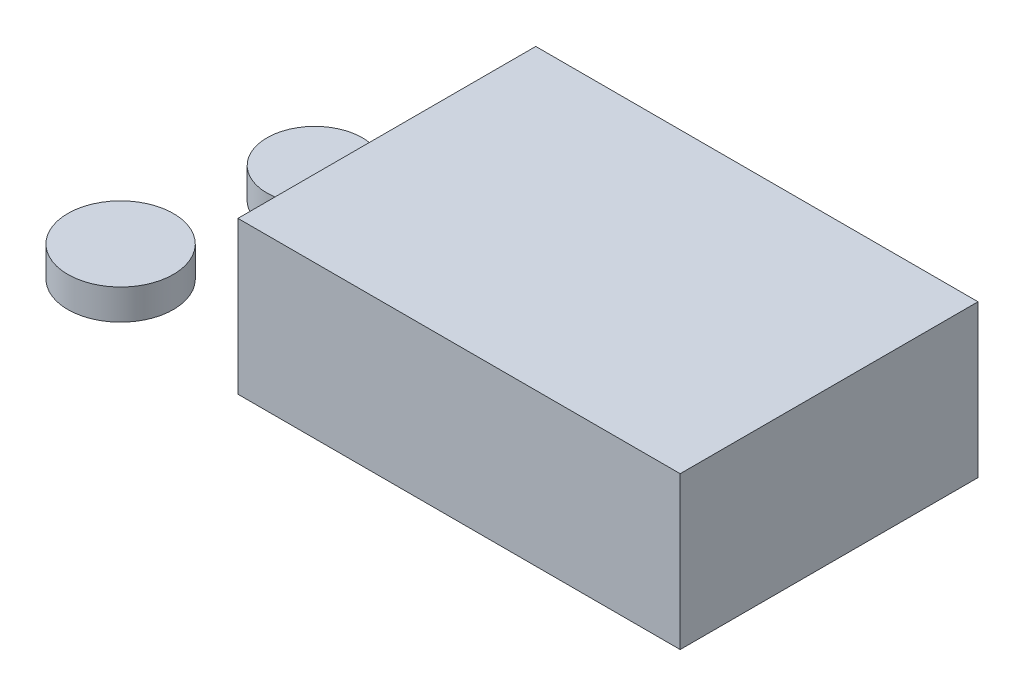
ISO-10303-21;
HEADER;
FILE_DESCRIPTION(('STEP AP214'),'2;1');
FILE_NAME('part.step','',(''),(''),'','','');
FILE_SCHEMA(('AUTOMOTIVE_DESIGN { 1 0 10303 214 1 1 1 1 }'));
ENDSEC;
DATA;
#1=APPLICATION_CONTEXT('core data for automotive mechanical design processes');
#2=APPLICATION_PROTOCOL_DEFINITION('international standard','automotive_design',2000,#1);
#3=PRODUCT_CONTEXT('',#1,'mechanical');
#4=PRODUCT('Part','Part','',(#3));
#5=PRODUCT_RELATED_PRODUCT_CATEGORY('part','',(#4));
#6=PRODUCT_DEFINITION_FORMATION('','',#4);
#7=PRODUCT_DEFINITION_CONTEXT('part definition',#1,'design');
#8=PRODUCT_DEFINITION('design','',#6,#7);
#9=PRODUCT_DEFINITION_SHAPE('','',#8);
#10=(LENGTH_UNIT() NAMED_UNIT(*) SI_UNIT(.MILLI.,.METRE.));
#11=(NAMED_UNIT(*) PLANE_ANGLE_UNIT() SI_UNIT($,.RADIAN.));
#12=(NAMED_UNIT(*) SI_UNIT($,.STERADIAN.) SOLID_ANGLE_UNIT());
#13=UNCERTAINTY_MEASURE_WITH_UNIT(LENGTH_MEASURE(1.E-05),#10,'distance_accuracy_value','');
#14=(GEOMETRIC_REPRESENTATION_CONTEXT(3) GLOBAL_UNCERTAINTY_ASSIGNED_CONTEXT((#13)) GLOBAL_UNIT_ASSIGNED_CONTEXT((#10,
#11,#12)) REPRESENTATION_CONTEXT('',''));
#15=CARTESIAN_POINT('',(0.,0.,0.));
#16=DIRECTION('',(0.,0.,1.));
#17=DIRECTION('',(1.,0.,0.));
#18=AXIS2_PLACEMENT_3D('',#15,#16,#17);
#19=CARTESIAN_POINT('',(-124.56959228351,10.,35.4048944559061));
#20=DIRECTION('',(0.,-1.,0.));
#21=DIRECTION('',(0.,0.,-1.));
#22=AXIS2_PLACEMENT_3D('',#19,#20,#21);
#23=CYLINDRICAL_SURFACE('',#22,17.3343195617082);
#24=CARTESIAN_POINT('',(-124.56959228351,10.,35.4048944559061));
#25=DIRECTION('',(0.,1.,0.));
#26=DIRECTION('',(0.,0.,1.));
#27=AXIS2_PLACEMENT_3D('',#24,#25,#26);
#28=CIRCLE('',#27,17.3343195617082);
#29=CARTESIAN_POINT('',(-124.56959228351,10.,52.7392140176143));
#30=VERTEX_POINT('',#29);
#31=EDGE_CURVE('E11',#30,#30,#28,.T.);
#32=ORIENTED_EDGE('',*,*,#31,.F.);
#33=EDGE_LOOP('',(#32));
#34=FACE_BOUND('',#33,.T.);
#35=CARTESIAN_POINT('',(-124.56959228351,0.,35.4048944559061));
#36=DIRECTION('',(0.,1.,0.));
#37=DIRECTION('',(0.,0.,1.));
#38=AXIS2_PLACEMENT_3D('',#35,#36,#37);
#39=CIRCLE('',#38,17.3343195617082);
#40=CARTESIAN_POINT('',(-124.56959228351,0.,52.7392140176143));
#41=VERTEX_POINT('',#40);
#42=EDGE_CURVE('E47',#41,#41,#39,.T.);
#43=ORIENTED_EDGE('',*,*,#42,.T.);
#44=EDGE_LOOP('',(#43));
#45=FACE_BOUND('',#44,.T.);
#46=ADVANCED_FACE('F44',(#34,#45),#23,.T.);
#47=CARTESIAN_POINT('',(-124.56959228351,10.,35.4048944559061));
#48=DIRECTION('',(0.,1.,0.));
#49=DIRECTION('',(0.,0.,1.));
#50=AXIS2_PLACEMENT_3D('',#47,#48,#49);
#51=PLANE('',#50);
#52=ORIENTED_EDGE('',*,*,#31,.T.);
#53=EDGE_LOOP('',(#52));
#54=FACE_BOUND('',#53,.T.);
#55=ADVANCED_FACE('F59',(#54),#51,.T.);
#56=CARTESIAN_POINT('',(-124.56959228351,0.,35.4048944559061));
#57=DIRECTION('',(0.,1.,0.));
#58=DIRECTION('',(0.,0.,1.));
#59=AXIS2_PLACEMENT_3D('',#56,#57,#58);
#60=PLANE('',#59);
#61=ORIENTED_EDGE('',*,*,#42,.F.);
#62=EDGE_LOOP('',(#61));
#63=FACE_BOUND('',#62,.T.);
#64=ADVANCED_FACE('F57',(#63),#60,.F.);
#65=CLOSED_SHELL('',(#46,#55,#64));
#66=MANIFOLD_SOLID_BREP('B2',#65);
#67=CARTESIAN_POINT('',(-115.030740926207,10.,-18.7852621270622));
#68=DIRECTION('',(0.,-1.,0.));
#69=DIRECTION('',(0.,0.,-1.));
#70=AXIS2_PLACEMENT_3D('',#67,#68,#69);
#71=CYLINDRICAL_SURFACE('',#70,15.6981780799688);
#72=CARTESIAN_POINT('',(-115.030740926207,10.,-18.7852621270622));
#73=DIRECTION('',(0.,1.,0.));
#74=DIRECTION('',(0.,0.,1.));
#75=AXIS2_PLACEMENT_3D('',#72,#73,#74);
#76=CIRCLE('',#75,15.6981780799688);
#77=CARTESIAN_POINT('',(-115.030740926207,10.,-3.08708404709336));
#78=VERTEX_POINT('',#77);
#79=EDGE_CURVE('E43',#78,#78,#76,.T.);
#80=ORIENTED_EDGE('',*,*,#79,.F.);
#81=EDGE_LOOP('',(#80));
#82=FACE_BOUND('',#81,.T.);
#83=CARTESIAN_POINT('',(-115.030740926207,0.,-18.7852621270622));
#84=DIRECTION('',(0.,1.,0.));
#85=DIRECTION('',(0.,0.,1.));
#86=AXIS2_PLACEMENT_3D('',#83,#84,#85);
#87=CIRCLE('',#86,15.6981780799688);
#88=CARTESIAN_POINT('',(-115.030740926207,0.,-3.08708404709336));
#89=VERTEX_POINT('',#88);
#90=EDGE_CURVE('E97',#89,#89,#87,.T.);
#91=ORIENTED_EDGE('',*,*,#90,.T.);
#92=EDGE_LOOP('',(#91));
#93=FACE_BOUND('',#92,.T.);
#94=ADVANCED_FACE('F94',(#82,#93),#71,.T.);
#95=CARTESIAN_POINT('',(-115.030740926207,10.,-18.7852621270622));
#96=DIRECTION('',(0.,1.,0.));
#97=DIRECTION('',(0.,0.,1.));
#98=AXIS2_PLACEMENT_3D('',#95,#96,#97);
#99=PLANE('',#98);
#100=ORIENTED_EDGE('',*,*,#79,.T.);
#101=EDGE_LOOP('',(#100));
#102=FACE_BOUND('',#101,.T.);
#103=ADVANCED_FACE('F109',(#102),#99,.T.);
#104=CARTESIAN_POINT('',(-115.030740926207,0.,-18.7852621270622));
#105=DIRECTION('',(0.,1.,0.));
#106=DIRECTION('',(0.,0.,1.));
#107=AXIS2_PLACEMENT_3D('',#104,#105,#106);
#108=PLANE('',#107);
#109=ORIENTED_EDGE('',*,*,#90,.F.);
#110=EDGE_LOOP('',(#109));
#111=FACE_BOUND('',#110,.T.);
#112=ADVANCED_FACE('F107',(#111),#108,.F.);
#113=CLOSED_SHELL('',(#94,#103,#112));
#114=MANIFOLD_SOLID_BREP('B6',#113);
#115=CARTESIAN_POINT('',(72.5812751737693,50.,48.8785340192358));
#116=DIRECTION('',(-1.,0.,0.));
#117=DIRECTION('',(0.,0.,1.));
#118=AXIS2_PLACEMENT_3D('',#115,#116,#117);
#119=PLANE('',#118);
#120=DIRECTION('',(0.,0.,-1.));
#121=VECTOR('',#120,1.);
#122=CARTESIAN_POINT('',(72.5812751737693,0.,48.8785340192358));
#123=LINE('',#122,#121);
#124=CARTESIAN_POINT('',(72.5812751737693,0.,48.8785340192358));
#125=VERTEX_POINT('',#124);
#126=CARTESIAN_POINT('',(72.5812751737693,0.,-48.8785340192358));
#127=VERTEX_POINT('',#126);
#128=EDGE_CURVE('E198',#125,#127,#123,.T.);
#129=ORIENTED_EDGE('',*,*,#128,.T.);
#130=DIRECTION('',(0.,-1.,0.));
#131=VECTOR('',#130,1.);
#132=CARTESIAN_POINT('',(72.5812751737693,50.,-48.8785340192358));
#133=LINE('',#132,#131);
#134=CARTESIAN_POINT('',(72.5812751737693,50.,-48.8785340192358));
#135=VERTEX_POINT('',#134);
#136=EDGE_CURVE('E92',#135,#127,#133,.T.);
#137=ORIENTED_EDGE('',*,*,#136,.F.);
#138=DIRECTION('',(0.,0.,-1.));
#139=VECTOR('',#138,1.);
#140=CARTESIAN_POINT('',(72.5812751737693,50.,48.8785340192358));
#141=LINE('',#140,#139);
#142=CARTESIAN_POINT('',(72.5812751737693,50.,48.8785340192358));
#143=VERTEX_POINT('',#142);
#144=EDGE_CURVE('E186',#143,#135,#141,.T.);
#145=ORIENTED_EDGE('',*,*,#144,.F.);
#146=DIRECTION('',(0.,-1.,0.));
#147=VECTOR('',#146,1.);
#148=CARTESIAN_POINT('',(72.5812751737693,50.,48.8785340192358));
#149=LINE('',#148,#147);
#150=EDGE_CURVE('E194',#143,#125,#149,.T.);
#151=ORIENTED_EDGE('',*,*,#150,.T.);
#152=EDGE_LOOP('',(#129,#137,#145,#151));
#153=FACE_BOUND('',#152,.T.);
#154=ADVANCED_FACE('F135',(#153),#119,.F.);
#155=CARTESIAN_POINT('',(-72.5812751737693,50.,-48.8785340192358));
#156=DIRECTION('',(0.,0.,1.));
#157=DIRECTION('',(1.,0.,0.));
#158=AXIS2_PLACEMENT_3D('',#155,#156,#157);
#159=PLANE('',#158);
#160=DIRECTION('',(-1.,0.,0.));
#161=VECTOR('',#160,1.);
#162=CARTESIAN_POINT('',(-72.5812751737693,0.,-48.8785340192358));
#163=LINE('',#162,#161);
#164=CARTESIAN_POINT('',(-72.5812751737693,0.,-48.8785340192358));
#165=VERTEX_POINT('',#164);
#166=EDGE_CURVE('E190',#127,#165,#163,.T.);
#167=ORIENTED_EDGE('',*,*,#166,.T.);
#168=DIRECTION('',(0.,-1.,0.));
#169=VECTOR('',#168,1.);
#170=CARTESIAN_POINT('',(-72.5812751737693,50.,-48.8785340192358));
#171=LINE('',#170,#169);
#172=CARTESIAN_POINT('',(-72.5812751737693,50.,-48.8785340192358));
#173=VERTEX_POINT('',#172);
#174=EDGE_CURVE('E143',#173,#165,#171,.T.);
#175=ORIENTED_EDGE('',*,*,#174,.F.);
#176=DIRECTION('',(-1.,0.,0.));
#177=VECTOR('',#176,1.);
#178=CARTESIAN_POINT('',(-72.5812751737693,50.,-48.8785340192358));
#179=LINE('',#178,#177);
#180=EDGE_CURVE('E181',#135,#173,#179,.T.);
#181=ORIENTED_EDGE('',*,*,#180,.F.);
#182=ORIENTED_EDGE('',*,*,#136,.T.);
#183=EDGE_LOOP('',(#167,#175,#181,#182));
#184=FACE_BOUND('',#183,.T.);
#185=ADVANCED_FACE('F189',(#184),#159,.F.);
#186=CARTESIAN_POINT('',(-72.5812751737693,50.,48.8785340192358));
#187=DIRECTION('',(1.,0.,0.));
#188=DIRECTION('',(0.,0.,-1.));
#189=AXIS2_PLACEMENT_3D('',#186,#187,#188);
#190=PLANE('',#189);
#191=DIRECTION('',(0.,0.,1.));
#192=VECTOR('',#191,1.);
#193=CARTESIAN_POINT('',(-72.5812751737693,0.,48.8785340192358));
#194=LINE('',#193,#192);
#195=CARTESIAN_POINT('',(-72.5812751737693,0.,48.8785340192358));
#196=VERTEX_POINT('',#195);
#197=EDGE_CURVE('E168',#165,#196,#194,.T.);
#198=ORIENTED_EDGE('',*,*,#197,.T.);
#199=DIRECTION('',(0.,-1.,0.));
#200=VECTOR('',#199,1.);
#201=CARTESIAN_POINT('',(-72.5812751737693,50.,48.8785340192358));
#202=LINE('',#201,#200);
#203=CARTESIAN_POINT('',(-72.5812751737693,50.,48.8785340192358));
#204=VERTEX_POINT('',#203);
#205=EDGE_CURVE('E191',#204,#196,#202,.T.);
#206=ORIENTED_EDGE('',*,*,#205,.F.);
#207=DIRECTION('',(0.,0.,1.));
#208=VECTOR('',#207,1.);
#209=CARTESIAN_POINT('',(-72.5812751737693,50.,48.8785340192358));
#210=LINE('',#209,#208);
#211=EDGE_CURVE('E184',#173,#204,#210,.T.);
#212=ORIENTED_EDGE('',*,*,#211,.F.);
#213=ORIENTED_EDGE('',*,*,#174,.T.);
#214=EDGE_LOOP('',(#198,#206,#212,#213));
#215=FACE_BOUND('',#214,.T.);
#216=ADVANCED_FACE('F192',(#215),#190,.F.);
#217=CARTESIAN_POINT('',(-72.5812751737693,50.,48.8785340192358));
#218=DIRECTION('',(0.,0.,-1.));
#219=DIRECTION('',(-1.,0.,0.));
#220=AXIS2_PLACEMENT_3D('',#217,#218,#219);
#221=PLANE('',#220);
#222=DIRECTION('',(1.,0.,0.));
#223=VECTOR('',#222,1.);
#224=CARTESIAN_POINT('',(-72.5812751737693,0.,48.8785340192358));
#225=LINE('',#224,#223);
#226=EDGE_CURVE('E174',#196,#125,#225,.T.);
#227=ORIENTED_EDGE('',*,*,#226,.T.);
#228=ORIENTED_EDGE('',*,*,#150,.F.);
#229=DIRECTION('',(1.,0.,0.));
#230=VECTOR('',#229,1.);
#231=CARTESIAN_POINT('',(-72.5812751737693,50.,48.8785340192358));
#232=LINE('',#231,#230);
#233=EDGE_CURVE('E151',#204,#143,#232,.T.);
#234=ORIENTED_EDGE('',*,*,#233,.F.);
#235=ORIENTED_EDGE('',*,*,#205,.T.);
#236=EDGE_LOOP('',(#227,#228,#234,#235));
#237=FACE_BOUND('',#236,.T.);
#238=ADVANCED_FACE('F205',(#237),#221,.F.);
#239=CARTESIAN_POINT('',(0.,50.,0.));
#240=DIRECTION('',(0.,-1.,0.));
#241=DIRECTION('',(0.,0.,-1.));
#242=AXIS2_PLACEMENT_3D('',#239,#240,#241);
#243=PLANE('',#242);
#244=ORIENTED_EDGE('',*,*,#144,.T.);
#245=ORIENTED_EDGE('',*,*,#180,.T.);
#246=ORIENTED_EDGE('',*,*,#211,.T.);
#247=ORIENTED_EDGE('',*,*,#233,.T.);
#248=EDGE_LOOP('',(#244,#245,#246,#247));
#249=FACE_BOUND('',#248,.T.);
#250=ADVANCED_FACE('F182',(#249),#243,.F.);
#251=CARTESIAN_POINT('',(0.,0.,0.));
#252=DIRECTION('',(0.,-1.,0.));
#253=DIRECTION('',(0.,0.,-1.));
#254=AXIS2_PLACEMENT_3D('',#251,#252,#253);
#255=PLANE('',#254);
#256=ORIENTED_EDGE('',*,*,#128,.F.);
#257=ORIENTED_EDGE('',*,*,#226,.F.);
#258=ORIENTED_EDGE('',*,*,#197,.F.);
#259=ORIENTED_EDGE('',*,*,#166,.F.);
#260=EDGE_LOOP('',(#256,#257,#258,#259));
#261=FACE_BOUND('',#260,.T.);
#262=ADVANCED_FACE('F208',(#261),#255,.T.);
#263=CLOSED_SHELL('',(#154,#185,#216,#238,#250,#262));
#264=MANIFOLD_SOLID_BREP('B38',#263);
#265=ADVANCED_BREP_SHAPE_REPRESENTATION('',(#18,#66,#114,#264),#14);
#266=SHAPE_DEFINITION_REPRESENTATION(#9,#265);
ENDSEC;
END-ISO-10303-21;
